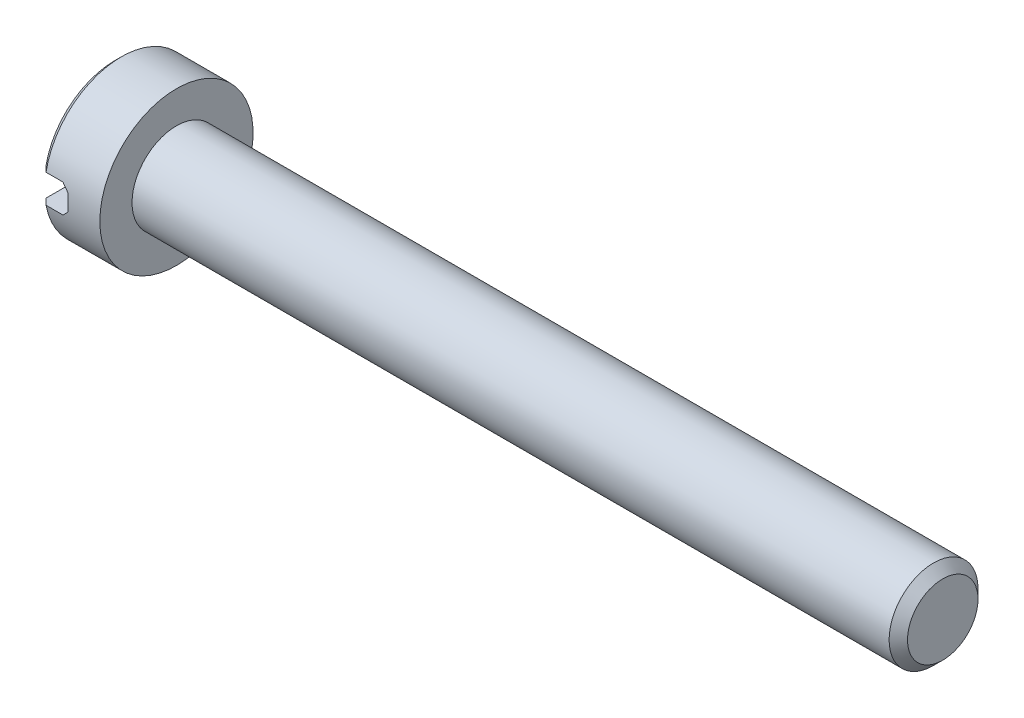
ISO-10303-21;
HEADER;
FILE_DESCRIPTION(('STEP AP214'),'2;1');
FILE_NAME('part.step','',(''),(''),'','','');
FILE_SCHEMA(('AUTOMOTIVE_DESIGN { 1 0 10303 214 1 1 1 1 }'));
ENDSEC;
DATA;
#1=APPLICATION_CONTEXT('core data for automotive mechanical design processes');
#2=APPLICATION_PROTOCOL_DEFINITION('international standard','automotive_design',2000,#1);
#3=PRODUCT_CONTEXT('',#1,'mechanical');
#4=PRODUCT('Part','Part','',(#3));
#5=PRODUCT_RELATED_PRODUCT_CATEGORY('part','',(#4));
#6=PRODUCT_DEFINITION_FORMATION('','',#4);
#7=PRODUCT_DEFINITION_CONTEXT('part definition',#1,'design');
#8=PRODUCT_DEFINITION('design','',#6,#7);
#9=PRODUCT_DEFINITION_SHAPE('','',#8);
#10=(LENGTH_UNIT() NAMED_UNIT(*) SI_UNIT(.MILLI.,.METRE.));
#11=(NAMED_UNIT(*) PLANE_ANGLE_UNIT() SI_UNIT($,.RADIAN.));
#12=(NAMED_UNIT(*) SI_UNIT($,.STERADIAN.) SOLID_ANGLE_UNIT());
#13=UNCERTAINTY_MEASURE_WITH_UNIT(LENGTH_MEASURE(1.E-05),#10,'distance_accuracy_value','');
#14=(GEOMETRIC_REPRESENTATION_CONTEXT(3) GLOBAL_UNCERTAINTY_ASSIGNED_CONTEXT((#13)) GLOBAL_UNIT_ASSIGNED_CONTEXT((#10,
#11,#12)) REPRESENTATION_CONTEXT('',''));
#15=CARTESIAN_POINT('',(0.,0.,0.));
#16=DIRECTION('',(0.,0.,1.));
#17=DIRECTION('',(1.,0.,0.));
#18=AXIS2_PLACEMENT_3D('',#15,#16,#17);
#19=CARTESIAN_POINT('',(2.,2.5,0.));
#20=DIRECTION('',(-1.,0.,0.));
#21=DIRECTION('',(0.,0.,1.));
#22=AXIS2_PLACEMENT_3D('',#19,#20,#21);
#23=PLANE('',#22);
#24=CARTESIAN_POINT('',(2.,0.,0.));
#25=DIRECTION('',(-1.,0.,0.));
#26=DIRECTION('',(0.,0.,1.));
#27=AXIS2_PLACEMENT_3D('',#24,#25,#26);
#28=CIRCLE('',#27,2.5);
#29=CARTESIAN_POINT('',(2.,0.,2.5));
#30=VERTEX_POINT('',#29);
#31=EDGE_CURVE('E191',#30,#30,#28,.T.);
#32=ORIENTED_EDGE('',*,*,#31,.F.);
#33=EDGE_LOOP('',(#32));
#34=FACE_BOUND('',#33,.T.);
#35=CARTESIAN_POINT('',(2.,0.,0.));
#36=DIRECTION('',(-1.,0.,0.));
#37=DIRECTION('',(0.,0.,1.));
#38=AXIS2_PLACEMENT_3D('',#35,#36,#37);
#39=CIRCLE('',#38,1.45);
#40=CARTESIAN_POINT('',(2.,0.,1.45));
#41=VERTEX_POINT('',#40);
#42=EDGE_CURVE('E142',#41,#41,#39,.F.);
#43=ORIENTED_EDGE('',*,*,#42,.F.);
#44=EDGE_LOOP('',(#43));
#45=FACE_BOUND('',#44,.T.);
#46=ADVANCED_FACE('F30',(#34,#45),#23,.F.);
#47=CARTESIAN_POINT('',(0.,0.,0.));
#48=DIRECTION('',(1.,0.,0.));
#49=DIRECTION('',(0.,0.,-1.));
#50=AXIS2_PLACEMENT_3D('',#47,#48,#49);
#51=PLANE('',#50);
#52=CARTESIAN_POINT('',(0.,0.,0.));
#53=DIRECTION('',(-1.,0.,0.));
#54=DIRECTION('',(0.,0.,1.));
#55=AXIS2_PLACEMENT_3D('',#52,#53,#54);
#56=CIRCLE('',#55,2.3);
#57=CARTESIAN_POINT('',(0.,0.465549348230913,2.25239068644003));
#58=VERTEX_POINT('',#57);
#59=CARTESIAN_POINT('',(0.,0.465549348230913,-2.25239068644003));
#60=VERTEX_POINT('',#59);
#61=EDGE_CURVE('E112',#58,#60,#56,.T.);
#62=ORIENTED_EDGE('',*,*,#61,.T.);
#63=DIRECTION('',(0.,0.,1.));
#64=VECTOR('',#63,1.);
#65=CARTESIAN_POINT('',(0.,0.465549348230913,-5.));
#66=LINE('',#65,#64);
#67=EDGE_CURVE('E105',#60,#58,#66,.T.);
#68=ORIENTED_EDGE('',*,*,#67,.T.);
#69=EDGE_LOOP('',(#62,#68));
#70=FACE_BOUND('',#69,.T.);
#71=ADVANCED_FACE('F160',(#70),#51,.F.);
#72=CARTESIAN_POINT('',(0.199999999999999,0.,0.));
#73=DIRECTION('',(1.,0.,0.));
#74=DIRECTION('',(0.,0.,-1.));
#75=AXIS2_PLACEMENT_3D('',#72,#73,#74);
#76=CONICAL_SURFACE('',#75,2.5,0.785398163397449);
#77=CARTESIAN_POINT('',(0.199999999999999,0.,0.));
#78=DIRECTION('',(-1.,0.,0.));
#79=DIRECTION('',(0.,0.,1.));
#80=AXIS2_PLACEMENT_3D('',#77,#78,#79);
#81=CIRCLE('',#80,2.5);
#82=CARTESIAN_POINT('',(0.199999999999999,0.465549348230913,2.45627030360296));
#83=VERTEX_POINT('',#82);
#84=CARTESIAN_POINT('',(0.199999999999999,0.465549348230913,-2.45627030360296));
#85=VERTEX_POINT('',#84);
#86=EDGE_CURVE('E113',#83,#85,#81,.T.);
#87=ORIENTED_EDGE('',*,*,#86,.T.);
#88=CARTESIAN_POINT('',(3.20259904076724,0.465549348230913,-5.48286968729098));
#89=CARTESIAN_POINT('',(3.00738145959935,0.465549348230913,-5.28694329289562));
#90=CARTESIAN_POINT('',(2.81219546067579,0.465549348230913,-5.09098538985915));
#91=CARTESIAN_POINT('',(2.42191937891038,0.465549348230913,-4.69895178557871));
#92=CARTESIAN_POINT('',(2.22682930219254,0.465549348230913,-4.50287607823863));
#93=CARTESIAN_POINT('',(1.83653240706011,0.465549348230913,-4.11030517611593));
#94=CARTESIAN_POINT('',(1.64132579611622,0.465549348230913,-3.91380977500139));
#95=CARTESIAN_POINT('',(1.25115924421647,0.465549348230913,-3.5205958702737));
#96=CARTESIAN_POINT('',(1.05619929014714,0.465549348230913,-3.32387737967475));
#97=CARTESIAN_POINT('',(0.678173026290467,0.465549348230913,-2.94168954193629));
#98=CARTESIAN_POINT('',(0.495084501131984,0.465549348230913,-2.75624219184759));
#99=CARTESIAN_POINT('',(0.220902938364077,0.465549348230913,-2.47759625217051));
#100=CARTESIAN_POINT('',(0.129576630819234,0.465549348230913,-2.38462728539377));
#101=CARTESIAN_POINT('',(-0.0528521527638735,0.465549348230913,-2.19847287291091));
#102=CARTESIAN_POINT('',(-0.143954632395991,0.465549348230913,-2.10528743072793));
#103=CARTESIAN_POINT('',(-0.3257621874117,0.465549348230913,-1.91867757427864));
#104=CARTESIAN_POINT('',(-0.416467526691374,0.465549348230913,-1.82525341749482));
#105=CARTESIAN_POINT('',(-0.597381873326264,0.465549348230913,-1.63791440165395));
#106=CARTESIAN_POINT('',(-0.687590849458519,0.465549348230913,-1.54399951243647));
#107=CARTESIAN_POINT('',(-0.867162247825726,0.465549348230913,-1.3554114454591));
#108=CARTESIAN_POINT('',(-0.956524909350583,0.465549348230913,-1.26073849690962));
#109=CARTESIAN_POINT('',(-1.08939468495382,0.465549348230913,-1.11764625640034));
#110=CARTESIAN_POINT('',(-1.1334867082123,0.465549348230913,-1.06977082072954));
#111=CARTESIAN_POINT('',(-1.2210969597667,0.465549348230913,-0.973498550024909));
#112=CARTESIAN_POINT('',(-1.26461520900373,0.465549348230913,-0.925101734137764));
#113=CARTESIAN_POINT('',(-1.3317610681347,0.465549348230913,-0.84906528915811));
#114=CARTESIAN_POINT('',(-1.35569012099074,0.465549348230913,-0.821692131835999));
#115=CARTESIAN_POINT('',(-1.40319102244514,0.465549348230913,-0.766632100193611));
#116=CARTESIAN_POINT('',(-1.42676283514449,0.465549348230913,-0.738945194827061));
#117=CARTESIAN_POINT('',(-1.47366376684455,0.465549348230913,-0.682886365346767));
#118=CARTESIAN_POINT('',(-1.49698800292058,0.465549348230913,-0.654510342179645));
#119=CARTESIAN_POINT('',(-1.54295549742156,0.465549348230913,-0.597221058712915));
#120=CARTESIAN_POINT('',(-1.56559892715386,0.465549348230913,-0.568307936573489));
#121=CARTESIAN_POINT('',(-1.61016736197608,0.465549348230913,-0.509419742712259));
#122=CARTESIAN_POINT('',(-1.63208156923063,0.465549348230913,-0.479436434264727));
#123=CARTESIAN_POINT('',(-1.67445976083722,0.465549348230913,-0.418389024408677));
#124=CARTESIAN_POINT('',(-1.69492180209863,0.465549348230913,-0.387323554832707));
#125=CARTESIAN_POINT('',(-1.73332185678116,0.465549348230913,-0.32406112418156));
#126=CARTESIAN_POINT('',(-1.75128287953761,0.465549348230913,-0.291878431816849));
#127=CARTESIAN_POINT('',(-1.78342369621955,0.465549348230913,-0.225717265309185));
#128=CARTESIAN_POINT('',(-1.79761500076547,0.465549348230913,-0.191744646392134));
#129=CARTESIAN_POINT('',(-1.81895609795713,0.465549348230913,-0.124795883091766));
#130=CARTESIAN_POINT('',(-1.82661289326591,0.465549348230913,-0.0919921322132619));
#131=CARTESIAN_POINT('',(-1.83488894775632,0.465549348230913,-0.0256267496241771));
#132=CARTESIAN_POINT('',(-1.83554895937427,0.465549348230913,0.0079293513286914));
#133=CARTESIAN_POINT('',(-1.82973306120756,0.465549348230913,0.0742464015597504));
#134=CARTESIAN_POINT('',(-1.82328333400206,0.465549348230913,0.107009817283791));
#135=CARTESIAN_POINT('',(-1.80956338762447,0.465549348230913,0.155027331571199));
#136=CARTESIAN_POINT('',(-1.80428518983903,0.465549348230913,0.170909212358322));
#137=CARTESIAN_POINT('',(-1.79261948745361,0.465549348230913,0.202260246274237));
#138=CARTESIAN_POINT('',(-1.78623214101843,0.465549348230913,0.21772945788739));
#139=CARTESIAN_POINT('',(-1.76761840023324,0.465549348230913,0.259328209218331));
#140=CARTESIAN_POINT('',(-1.7545143196465,0.465549348230913,0.285061417842785));
#141=CARTESIAN_POINT('',(-1.7265146961415,0.465549348230913,0.335544158020593));
#142=CARTESIAN_POINT('',(-1.71161720540743,0.465549348230913,0.360292580485517));
#143=CARTESIAN_POINT('',(-1.68054228203642,0.465549348230913,0.409079841714359));
#144=CARTESIAN_POINT('',(-1.66436078635795,0.465549348230913,0.433116068257988));
#145=CARTESIAN_POINT('',(-1.63111775750428,0.465549348230913,0.480575042863359));
#146=CARTESIAN_POINT('',(-1.61405601084805,0.465549348230913,0.503997640009445));
#147=CARTESIAN_POINT('',(-1.5616167270468,0.465549348230913,0.573971640763827));
#148=CARTESIAN_POINT('',(-1.52527399334496,0.465549348230913,0.619796593427047));
#149=CARTESIAN_POINT('',(-1.45124163289229,0.465549348230913,0.710149565111902));
#150=CARTESIAN_POINT('',(-1.41355526157427,0.465549348230913,0.7546802997551));
#151=CARTESIAN_POINT('',(-1.33810033893443,0.465549348230913,0.842013934301667));
#152=CARTESIAN_POINT('',(-1.30035092246978,0.465549348230913,0.88483340405098));
#153=CARTESIAN_POINT('',(-1.22427339982634,0.465549348230913,0.969954837541984));
#154=CARTESIAN_POINT('',(-1.18594527816913,0.465549348230913,1.01225678738678));
#155=CARTESIAN_POINT('',(-1.07035214447441,0.465549348230913,1.13862723555416));
#156=CARTESIAN_POINT('',(-0.992489260170285,0.465549348230913,1.2221479576561));
#157=CARTESIAN_POINT('',(-0.835814007667519,0.465549348230913,1.38847609582379));
#158=CARTESIAN_POINT('',(-0.757000620957104,0.465549348230913,1.47128254610905));
#159=CARTESIAN_POINT('',(-0.598849232799756,0.465549348230913,1.63637982121664));
#160=CARTESIAN_POINT('',(-0.519511274422272,0.465549348230913,1.71867068731607));
#161=CARTESIAN_POINT('',(-0.361217712976169,0.465549348230913,1.88216701603883));
#162=CARTESIAN_POINT('',(-0.282265248575712,0.465549348230913,1.9633755225318));
#163=CARTESIAN_POINT('',(-0.124123333736657,0.465549348230913,2.12556467511988));
#164=CARTESIAN_POINT('',(-0.0449338783726596,0.465549348230913,2.20654531641042));
#165=CARTESIAN_POINT('',(0.192811054539121,0.465549348230913,2.44916767308598));
#166=CARTESIAN_POINT('',(0.351615992082499,0.465549348230913,2.61056482504039));
#167=CARTESIAN_POINT('',(0.732972757071633,0.465549348230913,2.99726131212903));
#168=CARTESIAN_POINT('',(0.955700706319336,0.465549348230913,3.22238674752163));
#169=CARTESIAN_POINT('',(1.401572977937,0.465549348230913,3.67230050679293));
#170=CARTESIAN_POINT('',(1.62471736464727,0.465549348230913,3.89708876686418));
#171=CARTESIAN_POINT('',(2.07358635321306,0.465549348230913,4.34881324556589));
#172=CARTESIAN_POINT('',(2.29931333445495,0.465549348230913,4.57574709913376));
#173=CARTESIAN_POINT('',(2.7508805263624,0.465549348230913,5.02942321622608));
#174=CARTESIAN_POINT('',(2.97672071035443,0.465549348230913,5.2561655062971));
#175=CARTESIAN_POINT('',(3.20259904076724,0.465549348230913,5.48286968729098));
#176=B_SPLINE_CURVE_WITH_KNOTS('',3,(#88,#89,#90,#91,#92,#93,#94,#95,#96,#97,#98,#99,#100,#101,
#102,#103,#104,#105,#106,#107,#108,#109,#110,#111,#112,#113,#114,#115,#116,#117,#118,#119,#120,
#121,#122,#123,#124,#125,#126,#127,#128,#129,#130,#131,#132,#133,#134,#135,#136,#137,#138,#139,
#140,#141,#142,#143,#144,#145,#146,#147,#148,#149,#150,#151,#152,#153,#154,#155,#156,#157,#158,
#159,#160,#161,#162,#163,#164,#165,#166,#167,#168,#169,#170,#171,#172,#173,#174,#175),
.UNSPECIFIED.,.F.,.F.,(4,2,2,2,2,2,2,2,2,2,2,2,2,2,2,2,2,2,2,2,2,2,2,2,2,2,2,2,2,2,2,2,2,2,2,2,
2,2,2,2,2,2,2,4),(0.,0.829743073340615,1.65953360095568,2.49046340540359,3.32134700248162,
4.10314469139848,4.49410926633513,4.88506752224858,5.27570632324449,5.66636942212084,
6.05691855181898,6.25217337756,6.44742105722463,6.55649218217526,6.66557419594665,
6.77576205404667,6.88592195014922,6.99730763492697,7.10883965543406,7.21926609048525,
7.32935136450647,7.42981570469559,7.52969457133973,7.62920684560584,7.67938417859199,
7.72955436214784,7.81607261219315,7.90268569183183,7.98958470216181,8.07650488747966,
8.25190336684877,8.42690244879082,8.59814445390702,8.76939104731506,9.11193368974146,
9.45488345933612,9.79780541262763,10.1375912828317,10.4773842645597,11.1566564623285,
12.1067097788694,13.0569245869456,14.0171665517813,14.9772407465216),.UNSPECIFIED.);
#177=EDGE_CURVE('E53',#85,#60,#176,.T.);
#178=ORIENTED_EDGE('',*,*,#177,.T.);
#179=ORIENTED_EDGE('',*,*,#61,.F.);
#180=EDGE_CURVE('E185',#58,#83,#176,.T.);
#181=ORIENTED_EDGE('',*,*,#180,.T.);
#182=EDGE_LOOP('',(#87,#178,#179,#181));
#183=FACE_BOUND('',#182,.T.);
#184=ADVANCED_FACE('F166',(#183),#76,.T.);
#185=CARTESIAN_POINT('',(0.,-0.465549348230913,-2.25239068644003));
#186=VERTEX_POINT('',#185);
#187=CARTESIAN_POINT('',(0.,-0.465549348230913,2.25239068644003));
#188=VERTEX_POINT('',#187);
#189=EDGE_CURVE('E109',#186,#188,#56,.T.);
#190=ORIENTED_EDGE('',*,*,#189,.T.);
#191=DIRECTION('',(0.,0.,1.));
#192=VECTOR('',#191,1.);
#193=CARTESIAN_POINT('',(0.,-0.465549348230913,-5.));
#194=LINE('',#193,#192);
#195=EDGE_CURVE('E96',#186,#188,#194,.T.);
#196=ORIENTED_EDGE('',*,*,#195,.F.);
#197=EDGE_LOOP('',(#190,#196));
#198=FACE_BOUND('',#197,.T.);
#199=ADVANCED_FACE('F32',(#198),#51,.F.);
#200=CARTESIAN_POINT('',(0.199999999999999,-0.465549348230913,-2.45627030360296));
#201=VERTEX_POINT('',#200);
#202=CARTESIAN_POINT('',(0.199999999999999,-0.465549348230913,2.45627030360296));
#203=VERTEX_POINT('',#202);
#204=EDGE_CURVE('E117',#201,#203,#81,.T.);
#205=ORIENTED_EDGE('',*,*,#204,.T.);
#206=CARTESIAN_POINT('',(3.20259904076724,-0.465549348230913,5.48286968729098));
#207=CARTESIAN_POINT('',(3.00738145959935,-0.465549348230913,5.28694329289562));
#208=CARTESIAN_POINT('',(2.81219546067579,-0.465549348230913,5.09098538985915));
#209=CARTESIAN_POINT('',(2.42191937891037,-0.465549348230913,4.69895178557871));
#210=CARTESIAN_POINT('',(2.22682930219254,-0.465549348230913,4.50287607823863));
#211=CARTESIAN_POINT('',(1.83653240706011,-0.465549348230913,4.11030517611592));
#212=CARTESIAN_POINT('',(1.64132579611621,-0.465549348230913,3.91380977500139));
#213=CARTESIAN_POINT('',(1.25115924421646,-0.465549348230913,3.52059587027369));
#214=CARTESIAN_POINT('',(1.05619929014713,-0.465549348230913,3.32387737967474));
#215=CARTESIAN_POINT('',(0.67817302629046,-0.465549348230913,2.94168954193629));
#216=CARTESIAN_POINT('',(0.495084501131977,-0.465549348230913,2.75624219184758));
#217=CARTESIAN_POINT('',(0.220902938364071,-0.465549348230913,2.47759625217051));
#218=CARTESIAN_POINT('',(0.129576630819229,-0.465549348230913,2.38462728539377));
#219=CARTESIAN_POINT('',(-0.0528521527638772,-0.465549348230913,2.1984728729109));
#220=CARTESIAN_POINT('',(-0.143954632395994,-0.465549348230913,2.10528743072793));
#221=CARTESIAN_POINT('',(-0.325762187411703,-0.465549348230913,1.91867757427864));
#222=CARTESIAN_POINT('',(-0.416467526691376,-0.465549348230913,1.82525341749482));
#223=CARTESIAN_POINT('',(-0.597381873326266,-0.465549348230913,1.63791440165394));
#224=CARTESIAN_POINT('',(-0.687590849458521,-0.465549348230913,1.54399951243647));
#225=CARTESIAN_POINT('',(-0.867162247825727,-0.465549348230913,1.3554114454591));
#226=CARTESIAN_POINT('',(-0.956524909350584,-0.465549348230913,1.26073849690962));
#227=CARTESIAN_POINT('',(-1.08939468495382,-0.465549348230913,1.11764625640034));
#228=CARTESIAN_POINT('',(-1.1334867082123,-0.465549348230913,1.06977082072954));
#229=CARTESIAN_POINT('',(-1.2210969597667,-0.465549348230913,0.973498550024909));
#230=CARTESIAN_POINT('',(-1.26461520900373,-0.465549348230913,0.925101734137764));
#231=CARTESIAN_POINT('',(-1.3317610681347,-0.465549348230913,0.84906528915811));
#232=CARTESIAN_POINT('',(-1.35569012099074,-0.465549348230913,0.821692131835998));
#233=CARTESIAN_POINT('',(-1.40319102244514,-0.465549348230913,0.76663210019361));
#234=CARTESIAN_POINT('',(-1.42676283514449,-0.465549348230913,0.73894519482706));
#235=CARTESIAN_POINT('',(-1.47366376684455,-0.465549348230913,0.682886365346767));
#236=CARTESIAN_POINT('',(-1.49698800292058,-0.465549348230913,0.654510342179645));
#237=CARTESIAN_POINT('',(-1.54295549742156,-0.465549348230913,0.597221058712914));
#238=CARTESIAN_POINT('',(-1.56559892715386,-0.465549348230913,0.568307936573486));
#239=CARTESIAN_POINT('',(-1.61016736197608,-0.465549348230913,0.509419742712256));
#240=CARTESIAN_POINT('',(-1.63208156923063,-0.465549348230913,0.479436434264725));
#241=CARTESIAN_POINT('',(-1.67445976083722,-0.465549348230913,0.418389024408676));
#242=CARTESIAN_POINT('',(-1.69492180209863,-0.465549348230913,0.387323554832706));
#243=CARTESIAN_POINT('',(-1.73332185678116,-0.465549348230913,0.324061124181559));
#244=CARTESIAN_POINT('',(-1.75128287953761,-0.465549348230913,0.291878431816848));
#245=CARTESIAN_POINT('',(-1.78342369621955,-0.465549348230913,0.225717265309185));
#246=CARTESIAN_POINT('',(-1.79761500076547,-0.465549348230913,0.191744646392134));
#247=CARTESIAN_POINT('',(-1.81895609795713,-0.465549348230913,0.124795883091766));
#248=CARTESIAN_POINT('',(-1.82661289326591,-0.465549348230913,0.0919921322132619));
#249=CARTESIAN_POINT('',(-1.83488894775632,-0.465549348230913,0.0256267496241772));
#250=CARTESIAN_POINT('',(-1.83554895937427,-0.465549348230913,-0.00792935132869136));
#251=CARTESIAN_POINT('',(-1.82973306120756,-0.465549348230913,-0.0742464015597505));
#252=CARTESIAN_POINT('',(-1.82328333400206,-0.465549348230913,-0.107009817283791));
#253=CARTESIAN_POINT('',(-1.80956338762447,-0.465549348230913,-0.155027331571199));
#254=CARTESIAN_POINT('',(-1.80428518983903,-0.465549348230913,-0.170909212358322));
#255=CARTESIAN_POINT('',(-1.79261948745361,-0.465549348230913,-0.202260246274237));
#256=CARTESIAN_POINT('',(-1.78623214101843,-0.465549348230913,-0.21772945788739));
#257=CARTESIAN_POINT('',(-1.76761840023324,-0.465549348230913,-0.259328209218331));
#258=CARTESIAN_POINT('',(-1.7545143196465,-0.465549348230913,-0.285061417842786));
#259=CARTESIAN_POINT('',(-1.7265146961415,-0.465549348230913,-0.335544158020593));
#260=CARTESIAN_POINT('',(-1.71161720540743,-0.465549348230913,-0.360292580485517));
#261=CARTESIAN_POINT('',(-1.68054228203642,-0.465549348230913,-0.409079841714359));
#262=CARTESIAN_POINT('',(-1.66436078635795,-0.465549348230913,-0.433116068257988));
#263=CARTESIAN_POINT('',(-1.63111775750428,-0.465549348230913,-0.480575042863359));
#264=CARTESIAN_POINT('',(-1.61405601084805,-0.465549348230913,-0.503997640009445));
#265=CARTESIAN_POINT('',(-1.5616167270468,-0.465549348230913,-0.573971640763826));
#266=CARTESIAN_POINT('',(-1.52527399334496,-0.465549348230913,-0.619796593427046));
#267=CARTESIAN_POINT('',(-1.45124163289229,-0.465549348230913,-0.710149565111901));
#268=CARTESIAN_POINT('',(-1.41355526157427,-0.465549348230913,-0.7546802997551));
#269=CARTESIAN_POINT('',(-1.33810033893443,-0.465549348230913,-0.842013934301667));
#270=CARTESIAN_POINT('',(-1.30035092246978,-0.465549348230913,-0.884833404050981));
#271=CARTESIAN_POINT('',(-1.22427339982634,-0.465549348230913,-0.969954837541985));
#272=CARTESIAN_POINT('',(-1.18594527816913,-0.465549348230913,-1.01225678738678));
#273=CARTESIAN_POINT('',(-1.07035214447441,-0.465549348230913,-1.13862723555416));
#274=CARTESIAN_POINT('',(-0.992489260170284,-0.465549348230913,-1.2221479576561));
#275=CARTESIAN_POINT('',(-0.835814007667518,-0.465549348230913,-1.38847609582379));
#276=CARTESIAN_POINT('',(-0.757000620957102,-0.465549348230913,-1.47128254610905));
#277=CARTESIAN_POINT('',(-0.598849232799754,-0.465549348230913,-1.63637982121664));
#278=CARTESIAN_POINT('',(-0.51951127442227,-0.465549348230913,-1.71867068731607));
#279=CARTESIAN_POINT('',(-0.361217712976166,-0.465549348230913,-1.88216701603883));
#280=CARTESIAN_POINT('',(-0.282265248575709,-0.465549348230913,-1.96337552253181));
#281=CARTESIAN_POINT('',(-0.124123333736653,-0.465549348230913,-2.12556467511988));
#282=CARTESIAN_POINT('',(-0.044933878372656,-0.465549348230913,-2.20654531641042));
#283=CARTESIAN_POINT('',(0.192811054539125,-0.465549348230913,-2.44916767308599));
#284=CARTESIAN_POINT('',(0.351615992082505,-0.465549348230913,-2.6105648250404));
#285=CARTESIAN_POINT('',(0.73297275707164,-0.465549348230913,-2.99726131212903));
#286=CARTESIAN_POINT('',(0.955700706319342,-0.465549348230913,-3.22238674752163));
#287=CARTESIAN_POINT('',(1.401572977937,-0.465549348230913,-3.67230050679294));
#288=CARTESIAN_POINT('',(1.62471736464727,-0.465549348230913,-3.89708876686419));
#289=CARTESIAN_POINT('',(2.07358635321307,-0.465549348230913,-4.34881324556589));
#290=CARTESIAN_POINT('',(2.29931333445495,-0.465549348230913,-4.57574709913377));
#291=CARTESIAN_POINT('',(2.75088052636241,-0.465549348230913,-5.02942321622608));
#292=CARTESIAN_POINT('',(2.97672071035443,-0.465549348230913,-5.2561655062971));
#293=CARTESIAN_POINT('',(3.20259904076724,-0.465549348230913,-5.48286968729098));
#294=B_SPLINE_CURVE_WITH_KNOTS('',3,(#206,#207,#208,#209,#210,#211,#212,#213,#214,#215,#216,
#217,#218,#219,#220,#221,#222,#223,#224,#225,#226,#227,#228,#229,#230,#231,#232,#233,#234,#235,
#236,#237,#238,#239,#240,#241,#242,#243,#244,#245,#246,#247,#248,#249,#250,#251,#252,#253,#254,
#255,#256,#257,#258,#259,#260,#261,#262,#263,#264,#265,#266,#267,#268,#269,#270,#271,#272,#273,
#274,#275,#276,#277,#278,#279,#280,#281,#282,#283,#284,#285,#286,#287,#288,#289,#290,#291,#292,
#293),.UNSPECIFIED.,.F.,.F.,(4,2,2,2,2,2,2,2,2,2,2,2,2,2,2,2,2,2,2,2,2,2,2,2,2,2,2,2,2,2,2,2,2,
2,2,2,2,2,2,2,2,2,2,4),(0.,0.829743073340616,1.65953360095569,2.4904634054036,3.32134700248163,
4.10314469139849,4.49410926633514,4.88506752224859,5.2757063232445,5.66636942212085,
6.05691855181898,6.25217337756,6.44742105722463,6.55649218217526,6.66557419594665,
6.77576205404667,6.88592195014922,6.99730763492697,7.10883965543406,7.21926609048525,
7.32935136450647,7.42981570469559,7.52969457133973,7.62920684560584,7.67938417859199,
7.72955436214784,7.81607261219315,7.90268569183183,7.9895847021618,8.07650488747965,
8.25190336684877,8.42690244879081,8.59814445390702,8.76939104731506,9.11193368974146,
9.45488345933612,9.79780541262763,10.1375912828318,10.4773842645597,11.1566564623285,
12.1067097788694,13.0569245869456,14.0171665517813,14.9772407465216),.UNSPECIFIED.);
#295=EDGE_CURVE('E104',#203,#188,#294,.T.);
#296=ORIENTED_EDGE('',*,*,#295,.T.);
#297=ORIENTED_EDGE('',*,*,#189,.F.);
#298=EDGE_CURVE('E93',#186,#201,#294,.T.);
#299=ORIENTED_EDGE('',*,*,#298,.T.);
#300=EDGE_LOOP('',(#205,#296,#297,#299));
#301=FACE_BOUND('',#300,.T.);
#302=ADVANCED_FACE('F111',(#301),#76,.T.);
#303=CARTESIAN_POINT('',(0.,0.,0.));
#304=DIRECTION('',(-1.,0.,0.));
#305=DIRECTION('',(0.,0.,1.));
#306=AXIS2_PLACEMENT_3D('',#303,#304,#305);
#307=CYLINDRICAL_SURFACE('',#306,2.5);
#308=ORIENTED_EDGE('',*,*,#86,.F.);
#309=DIRECTION('',(-1.,0.,0.));
#310=VECTOR('',#309,1.);
#311=CARTESIAN_POINT('',(0.,0.465549348230913,2.45627030360296));
#312=LINE('',#311,#310);
#313=CARTESIAN_POINT('',(0.753445065176911,0.465549348230913,2.45627030360296));
#314=VERTEX_POINT('',#313);
#315=EDGE_CURVE('E139',#83,#314,#312,.F.);
#316=ORIENTED_EDGE('',*,*,#315,.T.);
#317=CARTESIAN_POINT('',(1.21899441340782,0.,0.));
#318=DIRECTION('',(0.707106781186548,0.707106781186548,0.));
#319=DIRECTION('',(-0.707106781186548,0.707106781186548,0.));
#320=AXIS2_PLACEMENT_3D('',#317,#318,#319);
#321=ELLIPSE('',#320,3.53553390593274,2.5);
#322=CARTESIAN_POINT('',(0.95344506517691,0.265549348230913,2.48585670215605));
#323=VERTEX_POINT('',#322);
#324=EDGE_CURVE('E134',#314,#323,#321,.T.);
#325=ORIENTED_EDGE('',*,*,#324,.T.);
#326=CARTESIAN_POINT('',(0.95344506517691,0.,0.));
#327=DIRECTION('',(1.,0.,0.));
#328=DIRECTION('',(0.,0.,-1.));
#329=AXIS2_PLACEMENT_3D('',#326,#327,#328);
#330=CIRCLE('',#329,2.5);
#331=CARTESIAN_POINT('',(0.95344506517691,-0.265549348230913,2.48585670215605));
#332=VERTEX_POINT('',#331);
#333=EDGE_CURVE('E130',#323,#332,#330,.T.);
#334=ORIENTED_EDGE('',*,*,#333,.T.);
#335=CARTESIAN_POINT('',(1.21899441340782,0.,0.));
#336=DIRECTION('',(0.707106781186548,-0.707106781186548,0.));
#337=DIRECTION('',(-0.707106781186548,-0.707106781186548,0.));
#338=AXIS2_PLACEMENT_3D('',#335,#336,#337);
#339=ELLIPSE('',#338,3.53553390593274,2.5);
#340=CARTESIAN_POINT('',(0.753445065176911,-0.465549348230913,2.45627030360296));
#341=VERTEX_POINT('',#340);
#342=EDGE_CURVE('E126',#332,#341,#339,.T.);
#343=ORIENTED_EDGE('',*,*,#342,.T.);
#344=DIRECTION('',(-1.,0.,0.));
#345=VECTOR('',#344,1.);
#346=CARTESIAN_POINT('',(0.,-0.465549348230913,2.45627030360296));
#347=LINE('',#346,#345);
#348=EDGE_CURVE('E136',#341,#203,#347,.T.);
#349=ORIENTED_EDGE('',*,*,#348,.T.);
#350=ORIENTED_EDGE('',*,*,#204,.F.);
#351=DIRECTION('',(-1.,0.,0.));
#352=VECTOR('',#351,1.);
#353=CARTESIAN_POINT('',(0.,-0.465549348230913,-2.45627030360296));
#354=LINE('',#353,#352);
#355=CARTESIAN_POINT('',(0.753445065176911,-0.465549348230913,-2.45627030360296));
#356=VERTEX_POINT('',#355);
#357=EDGE_CURVE('E99',#201,#356,#354,.F.);
#358=ORIENTED_EDGE('',*,*,#357,.T.);
#359=CARTESIAN_POINT('',(0.95344506517691,-0.265549348230913,-2.48585670215605));
#360=VERTEX_POINT('',#359);
#361=EDGE_CURVE('E122',#356,#360,#339,.T.);
#362=ORIENTED_EDGE('',*,*,#361,.T.);
#363=CARTESIAN_POINT('',(0.95344506517691,0.265549348230913,-2.48585670215605));
#364=VERTEX_POINT('',#363);
#365=EDGE_CURVE('E125',#360,#364,#330,.T.);
#366=ORIENTED_EDGE('',*,*,#365,.T.);
#367=CARTESIAN_POINT('',(0.753445065176911,0.465549348230913,-2.45627030360296));
#368=VERTEX_POINT('',#367);
#369=EDGE_CURVE('E129',#364,#368,#321,.T.);
#370=ORIENTED_EDGE('',*,*,#369,.T.);
#371=DIRECTION('',(-1.,0.,0.));
#372=VECTOR('',#371,1.);
#373=CARTESIAN_POINT('',(0.,0.465549348230913,-2.45627030360296));
#374=LINE('',#373,#372);
#375=EDGE_CURVE('E133',#368,#85,#374,.T.);
#376=ORIENTED_EDGE('',*,*,#375,.T.);
#377=EDGE_LOOP('',(#308,#316,#325,#334,#343,#349,#350,#358,#362,#366,#370,#376));
#378=FACE_BOUND('',#377,.T.);
#379=ORIENTED_EDGE('',*,*,#31,.T.);
#380=EDGE_LOOP('',(#379));
#381=FACE_BOUND('',#380,.T.);
#382=ADVANCED_FACE('F174',(#378,#381),#307,.T.);
#383=CARTESIAN_POINT('',(0.,0.465549348230913,-5.));
#384=DIRECTION('',(0.,1.,0.));
#385=DIRECTION('',(0.,0.,1.));
#386=AXIS2_PLACEMENT_3D('',#383,#384,#385);
#387=PLANE('',#386);
#388=ORIENTED_EDGE('',*,*,#375,.F.);
#389=DIRECTION('',(0.,0.,1.));
#390=VECTOR('',#389,1.);
#391=CARTESIAN_POINT('',(0.753445065176911,0.465549348230913,-5.));
#392=LINE('',#391,#390);
#393=EDGE_CURVE('E221',#368,#314,#392,.T.);
#394=ORIENTED_EDGE('',*,*,#393,.T.);
#395=ORIENTED_EDGE('',*,*,#315,.F.);
#396=ORIENTED_EDGE('',*,*,#180,.F.);
#397=ORIENTED_EDGE('',*,*,#67,.F.);
#398=ORIENTED_EDGE('',*,*,#177,.F.);
#399=EDGE_LOOP('',(#388,#394,#395,#396,#397,#398));
#400=FACE_BOUND('',#399,.T.);
#401=ADVANCED_FACE('F176',(#400),#387,.F.);
#402=CARTESIAN_POINT('',(0.753445065176911,0.465549348230913,-5.));
#403=DIRECTION('',(0.707106781186548,0.707106781186548,0.));
#404=DIRECTION('',(-0.707106781186548,0.707106781186548,0.));
#405=AXIS2_PLACEMENT_3D('',#402,#403,#404);
#406=PLANE('',#405);
#407=ORIENTED_EDGE('',*,*,#393,.F.);
#408=ORIENTED_EDGE('',*,*,#369,.F.);
#409=DIRECTION('',(0.,0.,1.));
#410=VECTOR('',#409,1.);
#411=CARTESIAN_POINT('',(0.95344506517691,0.265549348230913,-5.));
#412=LINE('',#411,#410);
#413=EDGE_CURVE('E223',#364,#323,#412,.T.);
#414=ORIENTED_EDGE('',*,*,#413,.T.);
#415=ORIENTED_EDGE('',*,*,#324,.F.);
#416=EDGE_LOOP('',(#407,#408,#414,#415));
#417=FACE_BOUND('',#416,.T.);
#418=ADVANCED_FACE('F196',(#417),#406,.F.);
#419=CARTESIAN_POINT('',(0.95344506517691,0.265549348230913,-5.));
#420=DIRECTION('',(1.,0.,0.));
#421=DIRECTION('',(0.,0.,-1.));
#422=AXIS2_PLACEMENT_3D('',#419,#420,#421);
#423=PLANE('',#422);
#424=ORIENTED_EDGE('',*,*,#413,.F.);
#425=ORIENTED_EDGE('',*,*,#365,.F.);
#426=DIRECTION('',(0.,0.,1.));
#427=VECTOR('',#426,1.);
#428=CARTESIAN_POINT('',(0.95344506517691,-0.265549348230913,-5.));
#429=LINE('',#428,#427);
#430=EDGE_CURVE('E212',#360,#332,#429,.T.);
#431=ORIENTED_EDGE('',*,*,#430,.T.);
#432=ORIENTED_EDGE('',*,*,#333,.F.);
#433=EDGE_LOOP('',(#424,#425,#431,#432));
#434=FACE_BOUND('',#433,.T.);
#435=ADVANCED_FACE('F199',(#434),#423,.F.);
#436=CARTESIAN_POINT('',(0.753445065176911,-0.465549348230913,-5.));
#437=DIRECTION('',(0.707106781186548,-0.707106781186548,0.));
#438=DIRECTION('',(0.707106781186548,0.707106781186548,0.));
#439=AXIS2_PLACEMENT_3D('',#436,#437,#438);
#440=PLANE('',#439);
#441=DIRECTION('',(0.,0.,1.));
#442=VECTOR('',#441,1.);
#443=CARTESIAN_POINT('',(0.753445065176911,-0.465549348230913,-5.));
#444=LINE('',#443,#442);
#445=EDGE_CURVE('E45',#356,#341,#444,.T.);
#446=ORIENTED_EDGE('',*,*,#445,.T.);
#447=ORIENTED_EDGE('',*,*,#342,.F.);
#448=ORIENTED_EDGE('',*,*,#430,.F.);
#449=ORIENTED_EDGE('',*,*,#361,.F.);
#450=EDGE_LOOP('',(#446,#447,#448,#449));
#451=FACE_BOUND('',#450,.T.);
#452=ADVANCED_FACE('F202',(#451),#440,.F.);
#453=CARTESIAN_POINT('',(0.,-0.465549348230913,-5.));
#454=DIRECTION('',(0.,-1.,0.));
#455=DIRECTION('',(0.,0.,-1.));
#456=AXIS2_PLACEMENT_3D('',#453,#454,#455);
#457=PLANE('',#456);
#458=ORIENTED_EDGE('',*,*,#348,.F.);
#459=ORIENTED_EDGE('',*,*,#445,.F.);
#460=ORIENTED_EDGE('',*,*,#357,.F.);
#461=ORIENTED_EDGE('',*,*,#298,.F.);
#462=ORIENTED_EDGE('',*,*,#195,.T.);
#463=ORIENTED_EDGE('',*,*,#295,.F.);
#464=EDGE_LOOP('',(#458,#459,#460,#461,#462,#463));
#465=FACE_BOUND('',#464,.T.);
#466=ADVANCED_FACE('F95',(#465),#457,.F.);
#467=CARTESIAN_POINT('',(27.,0.,0.));
#468=DIRECTION('',(-1.,0.,0.));
#469=DIRECTION('',(0.,0.,1.));
#470=AXIS2_PLACEMENT_3D('',#467,#468,#469);
#471=CYLINDRICAL_SURFACE('',#470,1.45);
#472=CARTESIAN_POINT('',(26.7,0.,0.));
#473=DIRECTION('',(1.,0.,0.));
#474=DIRECTION('',(0.,0.,-1.));
#475=AXIS2_PLACEMENT_3D('',#472,#473,#474);
#476=CIRCLE('',#475,1.45);
#477=CARTESIAN_POINT('',(26.7,0.,-1.45));
#478=VERTEX_POINT('',#477);
#479=EDGE_CURVE('E11',#478,#478,#476,.F.);
#480=ORIENTED_EDGE('',*,*,#479,.T.);
#481=EDGE_LOOP('',(#480));
#482=FACE_BOUND('',#481,.T.);
#483=ORIENTED_EDGE('',*,*,#42,.T.);
#484=EDGE_LOOP('',(#483));
#485=FACE_BOUND('',#484,.T.);
#486=ADVANCED_FACE('F156',(#482,#485),#471,.T.);
#487=CARTESIAN_POINT('',(27.,0.,0.));
#488=DIRECTION('',(1.,0.,0.));
#489=DIRECTION('',(0.,0.,-1.));
#490=AXIS2_PLACEMENT_3D('',#487,#488,#489);
#491=PLANE('',#490);
#492=CARTESIAN_POINT('',(27.,0.,0.));
#493=DIRECTION('',(1.,0.,0.));
#494=DIRECTION('',(0.,0.,-1.));
#495=AXIS2_PLACEMENT_3D('',#492,#493,#494);
#496=CIRCLE('',#495,1.15000000000001);
#497=CARTESIAN_POINT('',(27.,0.,-1.15000000000001));
#498=VERTEX_POINT('',#497);
#499=EDGE_CURVE('E38',#498,#498,#496,.T.);
#500=ORIENTED_EDGE('',*,*,#499,.T.);
#501=EDGE_LOOP('',(#500));
#502=FACE_BOUND('',#501,.T.);
#503=ADVANCED_FACE('F147',(#502),#491,.T.);
#504=CARTESIAN_POINT('',(27.,0.,0.));
#505=DIRECTION('',(-1.,0.,0.));
#506=DIRECTION('',(0.,0.,1.));
#507=AXIS2_PLACEMENT_3D('',#504,#505,#506);
#508=CONICAL_SURFACE('',#507,1.15000000000001,0.785398163397448);
#509=ORIENTED_EDGE('',*,*,#479,.F.);
#510=EDGE_LOOP('',(#509));
#511=FACE_BOUND('',#510,.T.);
#512=ORIENTED_EDGE('',*,*,#499,.F.);
#513=EDGE_LOOP('',(#512));
#514=FACE_BOUND('',#513,.T.);
#515=ADVANCED_FACE('F149',(#511,#514),#508,.T.);
#516=CLOSED_SHELL('',(#46,#71,#184,#199,#302,#382,#401,#418,#435,#452,#466,#486,#503,#515));
#517=MANIFOLD_SOLID_BREP('B2',#516);
#518=ADVANCED_BREP_SHAPE_REPRESENTATION('',(#18,#517),#14);
#519=SHAPE_DEFINITION_REPRESENTATION(#9,#518);
ENDSEC;
END-ISO-10303-21;
